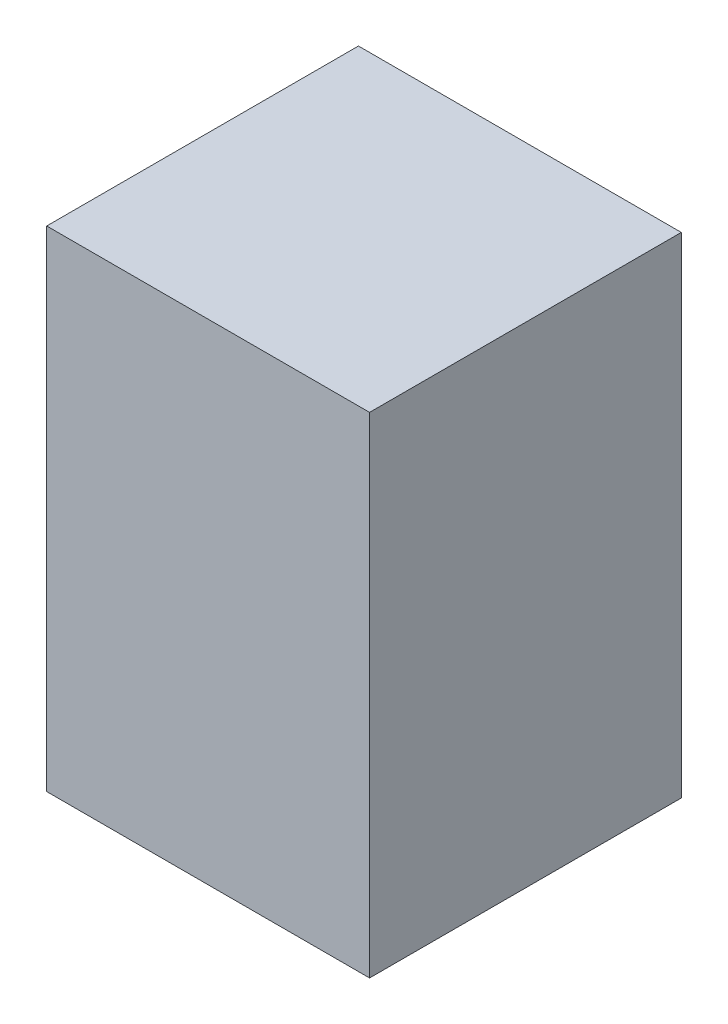
ISO-10303-21;
HEADER;
FILE_DESCRIPTION(('STEP AP214'),'2;1');
FILE_NAME('part.step','',(''),(''),'','','');
FILE_SCHEMA(('AUTOMOTIVE_DESIGN { 1 0 10303 214 1 1 1 1 }'));
ENDSEC;
DATA;
#1=APPLICATION_CONTEXT('core data for automotive mechanical design processes');
#2=APPLICATION_PROTOCOL_DEFINITION('international standard','automotive_design',2000,#1);
#3=PRODUCT_CONTEXT('',#1,'mechanical');
#4=PRODUCT('Part','Part','',(#3));
#5=PRODUCT_RELATED_PRODUCT_CATEGORY('part','',(#4));
#6=PRODUCT_DEFINITION_FORMATION('','',#4);
#7=PRODUCT_DEFINITION_CONTEXT('part definition',#1,'design');
#8=PRODUCT_DEFINITION('design','',#6,#7);
#9=PRODUCT_DEFINITION_SHAPE('','',#8);
#10=(LENGTH_UNIT() NAMED_UNIT(*) SI_UNIT(.MILLI.,.METRE.));
#11=(NAMED_UNIT(*) PLANE_ANGLE_UNIT() SI_UNIT($,.RADIAN.));
#12=(NAMED_UNIT(*) SI_UNIT($,.STERADIAN.) SOLID_ANGLE_UNIT());
#13=UNCERTAINTY_MEASURE_WITH_UNIT(LENGTH_MEASURE(1.E-05),#10,'distance_accuracy_value','');
#14=(GEOMETRIC_REPRESENTATION_CONTEXT(3) GLOBAL_UNCERTAINTY_ASSIGNED_CONTEXT((#13)) GLOBAL_UNIT_ASSIGNED_CONTEXT((#10,
#11,#12)) REPRESENTATION_CONTEXT('',''));
#15=CARTESIAN_POINT('',(0.,0.,0.));
#16=DIRECTION('',(0.,0.,1.));
#17=DIRECTION('',(1.,0.,0.));
#18=AXIS2_PLACEMENT_3D('',#15,#16,#17);
#19=CARTESIAN_POINT('',(-0.72499982,1.10000034,0.));
#20=DIRECTION('',(1.,0.,0.));
#21=DIRECTION('',(0.,-1.,0.));
#22=AXIS2_PLACEMENT_3D('',#19,#20,#21);
#23=PLANE('',#22);
#24=DIRECTION('',(0.,-1.,0.));
#25=VECTOR('',#24,1.);
#26=CARTESIAN_POINT('',(-0.72499982,1.10000034,0.));
#27=LINE('',#26,#25);
#28=CARTESIAN_POINT('',(-0.72499982,1.10000034,0.));
#29=VERTEX_POINT('',#28);
#30=CARTESIAN_POINT('',(-0.72499982,-1.10000034,0.));
#31=VERTEX_POINT('',#30);
#32=EDGE_CURVE('E11',#29,#31,#27,.T.);
#33=ORIENTED_EDGE('',*,*,#32,.T.);
#34=DIRECTION('',(0.,0.,1.));
#35=VECTOR('',#34,1.);
#36=CARTESIAN_POINT('',(-0.72499982,-1.10000034,0.));
#37=LINE('',#36,#35);
#38=CARTESIAN_POINT('',(-0.72499982,-1.10000034,1.39999974));
#39=VERTEX_POINT('',#38);
#40=EDGE_CURVE('E23',#31,#39,#37,.T.);
#41=ORIENTED_EDGE('',*,*,#40,.T.);
#42=DIRECTION('',(0.,-1.,0.));
#43=VECTOR('',#42,1.);
#44=CARTESIAN_POINT('',(-0.72499982,1.10000034,1.39999974));
#45=LINE('',#44,#43);
#46=CARTESIAN_POINT('',(-0.72499982,1.10000034,1.39999974));
#47=VERTEX_POINT('',#46);
#48=EDGE_CURVE('E86',#47,#39,#45,.T.);
#49=ORIENTED_EDGE('',*,*,#48,.F.);
#50=DIRECTION('',(0.,0.,1.));
#51=VECTOR('',#50,1.);
#52=CARTESIAN_POINT('',(-0.72499982,1.10000034,0.));
#53=LINE('',#52,#51);
#54=EDGE_CURVE('E35',#29,#47,#53,.T.);
#55=ORIENTED_EDGE('',*,*,#54,.F.);
#56=EDGE_LOOP('',(#33,#41,#49,#55));
#57=FACE_BOUND('',#56,.T.);
#58=ADVANCED_FACE('F16',(#57),#23,.F.);
#59=CARTESIAN_POINT('',(-0.72499982,-1.10000034,0.));
#60=DIRECTION('',(0.,1.,0.));
#61=DIRECTION('',(1.,0.,0.));
#62=AXIS2_PLACEMENT_3D('',#59,#60,#61);
#63=PLANE('',#62);
#64=DIRECTION('',(1.,0.,0.));
#65=VECTOR('',#64,1.);
#66=CARTESIAN_POINT('',(-0.72499982,-1.10000034,0.));
#67=LINE('',#66,#65);
#68=CARTESIAN_POINT('',(0.72499982,-1.10000034,0.));
#69=VERTEX_POINT('',#68);
#70=EDGE_CURVE('E83',#31,#69,#67,.T.);
#71=ORIENTED_EDGE('',*,*,#70,.T.);
#72=DIRECTION('',(0.,0.,1.));
#73=VECTOR('',#72,1.);
#74=CARTESIAN_POINT('',(0.72499982,-1.10000034,0.));
#75=LINE('',#74,#73);
#76=CARTESIAN_POINT('',(0.72499982,-1.10000034,1.39999974));
#77=VERTEX_POINT('',#76);
#78=EDGE_CURVE('E81',#69,#77,#75,.T.);
#79=ORIENTED_EDGE('',*,*,#78,.T.);
#80=DIRECTION('',(1.,0.,0.));
#81=VECTOR('',#80,1.);
#82=CARTESIAN_POINT('',(-0.72499982,-1.10000034,1.39999974));
#83=LINE('',#82,#81);
#84=EDGE_CURVE('E61',#39,#77,#83,.T.);
#85=ORIENTED_EDGE('',*,*,#84,.F.);
#86=ORIENTED_EDGE('',*,*,#40,.F.);
#87=EDGE_LOOP('',(#71,#79,#85,#86));
#88=FACE_BOUND('',#87,.T.);
#89=ADVANCED_FACE('F88',(#88),#63,.F.);
#90=CARTESIAN_POINT('',(0.72499982,-1.10000034,0.));
#91=DIRECTION('',(-1.,0.,0.));
#92=DIRECTION('',(0.,1.,0.));
#93=AXIS2_PLACEMENT_3D('',#90,#91,#92);
#94=PLANE('',#93);
#95=DIRECTION('',(0.,1.,0.));
#96=VECTOR('',#95,1.);
#97=CARTESIAN_POINT('',(0.72499982,-1.10000034,0.));
#98=LINE('',#97,#96);
#99=CARTESIAN_POINT('',(0.72499982,1.10000034,0.));
#100=VERTEX_POINT('',#99);
#101=EDGE_CURVE('E70',#69,#100,#98,.T.);
#102=ORIENTED_EDGE('',*,*,#101,.T.);
#103=DIRECTION('',(0.,0.,1.));
#104=VECTOR('',#103,1.);
#105=CARTESIAN_POINT('',(0.72499982,1.10000034,0.));
#106=LINE('',#105,#104);
#107=CARTESIAN_POINT('',(0.72499982,1.10000034,1.39999974));
#108=VERTEX_POINT('',#107);
#109=EDGE_CURVE('E64',#100,#108,#106,.T.);
#110=ORIENTED_EDGE('',*,*,#109,.T.);
#111=DIRECTION('',(0.,1.,0.));
#112=VECTOR('',#111,1.);
#113=CARTESIAN_POINT('',(0.72499982,-1.10000034,1.39999974));
#114=LINE('',#113,#112);
#115=EDGE_CURVE('E56',#77,#108,#114,.T.);
#116=ORIENTED_EDGE('',*,*,#115,.F.);
#117=ORIENTED_EDGE('',*,*,#78,.F.);
#118=EDGE_LOOP('',(#102,#110,#116,#117));
#119=FACE_BOUND('',#118,.T.);
#120=ADVANCED_FACE('F68',(#119),#94,.F.);
#121=CARTESIAN_POINT('',(0.72499982,1.10000034,0.));
#122=DIRECTION('',(0.,-1.,0.));
#123=DIRECTION('',(-1.,0.,0.));
#124=AXIS2_PLACEMENT_3D('',#121,#122,#123);
#125=PLANE('',#124);
#126=DIRECTION('',(-1.,0.,0.));
#127=VECTOR('',#126,1.);
#128=CARTESIAN_POINT('',(0.72499982,1.10000034,0.));
#129=LINE('',#128,#127);
#130=EDGE_CURVE('E65',#100,#29,#129,.T.);
#131=ORIENTED_EDGE('',*,*,#130,.T.);
#132=ORIENTED_EDGE('',*,*,#54,.T.);
#133=DIRECTION('',(-1.,0.,0.));
#134=VECTOR('',#133,1.);
#135=CARTESIAN_POINT('',(0.72499982,1.10000034,1.39999974));
#136=LINE('',#135,#134);
#137=EDGE_CURVE('E60',#108,#47,#136,.T.);
#138=ORIENTED_EDGE('',*,*,#137,.F.);
#139=ORIENTED_EDGE('',*,*,#109,.F.);
#140=EDGE_LOOP('',(#131,#132,#138,#139));
#141=FACE_BOUND('',#140,.T.);
#142=ADVANCED_FACE('F75',(#141),#125,.F.);
#143=CARTESIAN_POINT('',(-0.72499982,1.10000034,0.));
#144=DIRECTION('',(0.,0.,-1.));
#145=DIRECTION('',(-1.,0.,0.));
#146=AXIS2_PLACEMENT_3D('',#143,#144,#145);
#147=PLANE('',#146);
#148=ORIENTED_EDGE('',*,*,#130,.F.);
#149=ORIENTED_EDGE('',*,*,#101,.F.);
#150=ORIENTED_EDGE('',*,*,#70,.F.);
#151=ORIENTED_EDGE('',*,*,#32,.F.);
#152=EDGE_LOOP('',(#148,#149,#150,#151));
#153=FACE_BOUND('',#152,.T.);
#154=ADVANCED_FACE('F90',(#153),#147,.T.);
#155=CARTESIAN_POINT('',(-0.72499982,1.10000034,1.39999974));
#156=DIRECTION('',(0.,0.,-1.));
#157=DIRECTION('',(-1.,0.,0.));
#158=AXIS2_PLACEMENT_3D('',#155,#156,#157);
#159=PLANE('',#158);
#160=ORIENTED_EDGE('',*,*,#48,.T.);
#161=ORIENTED_EDGE('',*,*,#84,.T.);
#162=ORIENTED_EDGE('',*,*,#115,.T.);
#163=ORIENTED_EDGE('',*,*,#137,.T.);
#164=EDGE_LOOP('',(#160,#161,#162,#163));
#165=FACE_BOUND('',#164,.T.);
#166=ADVANCED_FACE('F58',(#165),#159,.F.);
#167=CLOSED_SHELL('',(#58,#89,#120,#142,#154,#166));
#168=MANIFOLD_SOLID_BREP('B1',#167);
#169=ADVANCED_BREP_SHAPE_REPRESENTATION('',(#18,#168),#14);
#170=SHAPE_DEFINITION_REPRESENTATION(#9,#169);
ENDSEC;
END-ISO-10303-21;
